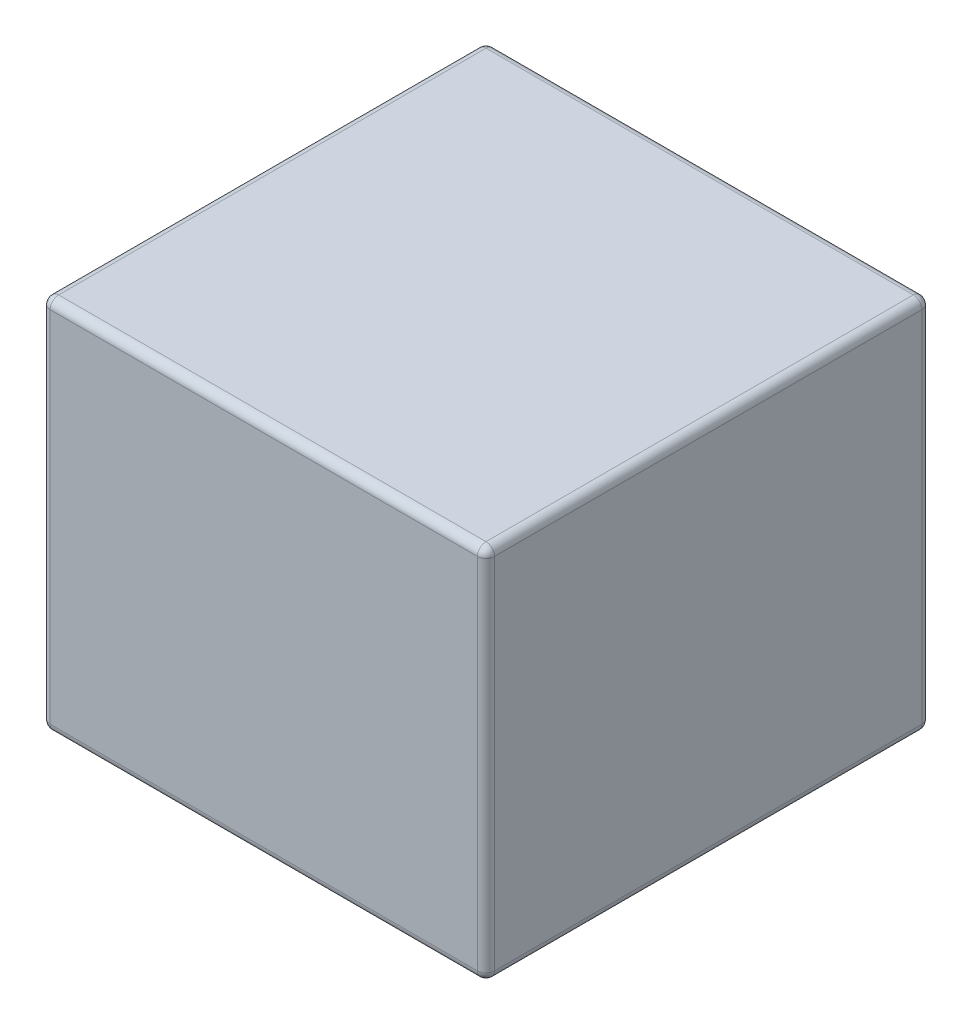
ISO-10303-21;
HEADER;
FILE_DESCRIPTION(('STEP AP214'),'2;1');
FILE_NAME('part.step','',(''),(''),'','','');
FILE_SCHEMA(('AUTOMOTIVE_DESIGN { 1 0 10303 214 1 1 1 1 }'));
ENDSEC;
DATA;
#1=APPLICATION_CONTEXT('core data for automotive mechanical design processes');
#2=APPLICATION_PROTOCOL_DEFINITION('international standard','automotive_design',2000,#1);
#3=PRODUCT_CONTEXT('',#1,'mechanical');
#4=PRODUCT('Part','Part','',(#3));
#5=PRODUCT_RELATED_PRODUCT_CATEGORY('part','',(#4));
#6=PRODUCT_DEFINITION_FORMATION('','',#4);
#7=PRODUCT_DEFINITION_CONTEXT('part definition',#1,'design');
#8=PRODUCT_DEFINITION('design','',#6,#7);
#9=PRODUCT_DEFINITION_SHAPE('','',#8);
#10=(LENGTH_UNIT() NAMED_UNIT(*) SI_UNIT(.MILLI.,.METRE.));
#11=(NAMED_UNIT(*) PLANE_ANGLE_UNIT() SI_UNIT($,.RADIAN.));
#12=(NAMED_UNIT(*) SI_UNIT($,.STERADIAN.) SOLID_ANGLE_UNIT());
#13=UNCERTAINTY_MEASURE_WITH_UNIT(LENGTH_MEASURE(1.E-05),#10,'distance_accuracy_value','');
#14=(GEOMETRIC_REPRESENTATION_CONTEXT(3) GLOBAL_UNCERTAINTY_ASSIGNED_CONTEXT((#13)) GLOBAL_UNIT_ASSIGNED_CONTEXT((#10,
#11,#12)) REPRESENTATION_CONTEXT('',''));
#15=CARTESIAN_POINT('',(0.,0.,0.));
#16=DIRECTION('',(0.,0.,1.));
#17=DIRECTION('',(1.,0.,0.));
#18=AXIS2_PLACEMENT_3D('',#15,#16,#17);
#19=CARTESIAN_POINT('',(0.,279.4,0.));
#20=DIRECTION('',(1.,0.,0.));
#21=DIRECTION('',(0.,0.,-1.));
#22=AXIS2_PLACEMENT_3D('',#19,#20,#21);
#23=PLANE('',#22);
#24=DIRECTION('',(0.,-1.,0.));
#25=VECTOR('',#24,1.);
#26=CARTESIAN_POINT('',(0.,279.4,-323.85));
#27=LINE('',#26,#25);
#28=CARTESIAN_POINT('',(0.,273.05,-323.85));
#29=VERTEX_POINT('',#28);
#30=CARTESIAN_POINT('',(0.,6.35000000000002,-323.85));
#31=VERTEX_POINT('',#30);
#32=EDGE_CURVE('E148',#29,#31,#27,.T.);
#33=ORIENTED_EDGE('',*,*,#32,.T.);
#34=DIRECTION('',(0.,0.,1.));
#35=VECTOR('',#34,1.);
#36=CARTESIAN_POINT('',(0.,6.35000000000002,0.));
#37=LINE('',#36,#35);
#38=CARTESIAN_POINT('',(0.,6.35000000000002,-6.35));
#39=VERTEX_POINT('',#38);
#40=EDGE_CURVE('E143',#31,#39,#37,.T.);
#41=ORIENTED_EDGE('',*,*,#40,.T.);
#42=DIRECTION('',(0.,-1.,0.));
#43=VECTOR('',#42,1.);
#44=CARTESIAN_POINT('',(0.,279.4,-6.35));
#45=LINE('',#44,#43);
#46=CARTESIAN_POINT('',(0.,273.05,-6.35));
#47=VERTEX_POINT('',#46);
#48=EDGE_CURVE('E138',#39,#47,#45,.F.);
#49=ORIENTED_EDGE('',*,*,#48,.T.);
#50=DIRECTION('',(0.,0.,1.));
#51=VECTOR('',#50,1.);
#52=CARTESIAN_POINT('',(0.,273.05,0.));
#53=LINE('',#52,#51);
#54=EDGE_CURVE('E140',#47,#29,#53,.F.);
#55=ORIENTED_EDGE('',*,*,#54,.T.);
#56=EDGE_LOOP('',(#33,#41,#49,#55));
#57=FACE_BOUND('',#56,.T.);
#58=ADVANCED_FACE('F38',(#57),#23,.F.);
#59=CARTESIAN_POINT('',(0.,279.4,0.));
#60=DIRECTION('',(0.,0.,-1.));
#61=DIRECTION('',(-1.,0.,0.));
#62=AXIS2_PLACEMENT_3D('',#59,#60,#61);
#63=PLANE('',#62);
#64=DIRECTION('',(0.,-1.,0.));
#65=VECTOR('',#64,1.);
#66=CARTESIAN_POINT('',(6.35,279.4,0.));
#67=LINE('',#66,#65);
#68=CARTESIAN_POINT('',(6.35,273.05,0.));
#69=VERTEX_POINT('',#68);
#70=CARTESIAN_POINT('',(6.35,6.35000000000002,0.));
#71=VERTEX_POINT('',#70);
#72=EDGE_CURVE('E172',#69,#71,#67,.T.);
#73=ORIENTED_EDGE('',*,*,#72,.T.);
#74=DIRECTION('',(1.,0.,0.));
#75=VECTOR('',#74,1.);
#76=CARTESIAN_POINT('',(330.2,6.35000000000002,0.));
#77=LINE('',#76,#75);
#78=CARTESIAN_POINT('',(323.85,6.35000000000002,0.));
#79=VERTEX_POINT('',#78);
#80=EDGE_CURVE('E265',#71,#79,#77,.T.);
#81=ORIENTED_EDGE('',*,*,#80,.T.);
#82=DIRECTION('',(0.,-1.,0.));
#83=VECTOR('',#82,1.);
#84=CARTESIAN_POINT('',(323.85,279.4,0.));
#85=LINE('',#84,#83);
#86=CARTESIAN_POINT('',(323.85,273.05,0.));
#87=VERTEX_POINT('',#86);
#88=EDGE_CURVE('E255',#79,#87,#85,.F.);
#89=ORIENTED_EDGE('',*,*,#88,.T.);
#90=DIRECTION('',(1.,0.,0.));
#91=VECTOR('',#90,1.);
#92=CARTESIAN_POINT('',(0.,273.05,0.));
#93=LINE('',#92,#91);
#94=EDGE_CURVE('E252',#87,#69,#93,.F.);
#95=ORIENTED_EDGE('',*,*,#94,.T.);
#96=EDGE_LOOP('',(#73,#81,#89,#95));
#97=FACE_BOUND('',#96,.T.);
#98=ADVANCED_FACE('F372',(#97),#63,.F.);
#99=CARTESIAN_POINT('',(330.2,279.4,0.));
#100=DIRECTION('',(-1.,0.,0.));
#101=DIRECTION('',(0.,0.,1.));
#102=AXIS2_PLACEMENT_3D('',#99,#100,#101);
#103=PLANE('',#102);
#104=DIRECTION('',(0.,0.,-1.));
#105=VECTOR('',#104,1.);
#106=CARTESIAN_POINT('',(330.2,6.35000000000002,-330.2));
#107=LINE('',#106,#105);
#108=CARTESIAN_POINT('',(330.2,6.35000000000002,-6.35));
#109=VERTEX_POINT('',#108);
#110=CARTESIAN_POINT('',(330.2,6.35000000000002,-323.85));
#111=VERTEX_POINT('',#110);
#112=EDGE_CURVE('E247',#109,#111,#107,.T.);
#113=ORIENTED_EDGE('',*,*,#112,.T.);
#114=DIRECTION('',(0.,-1.,0.));
#115=VECTOR('',#114,1.);
#116=CARTESIAN_POINT('',(330.2,279.4,-323.85));
#117=LINE('',#116,#115);
#118=CARTESIAN_POINT('',(330.2,273.05,-323.85));
#119=VERTEX_POINT('',#118);
#120=EDGE_CURVE('E244',#111,#119,#117,.F.);
#121=ORIENTED_EDGE('',*,*,#120,.T.);
#122=DIRECTION('',(0.,0.,-1.));
#123=VECTOR('',#122,1.);
#124=CARTESIAN_POINT('',(330.2,273.05,0.));
#125=LINE('',#124,#123);
#126=CARTESIAN_POINT('',(330.2,273.05,-6.35));
#127=VERTEX_POINT('',#126);
#128=EDGE_CURVE('E236',#119,#127,#125,.F.);
#129=ORIENTED_EDGE('',*,*,#128,.T.);
#130=DIRECTION('',(0.,-1.,0.));
#131=VECTOR('',#130,1.);
#132=CARTESIAN_POINT('',(330.2,279.4,-6.35));
#133=LINE('',#132,#131);
#134=EDGE_CURVE('E240',#127,#109,#133,.T.);
#135=ORIENTED_EDGE('',*,*,#134,.T.);
#136=EDGE_LOOP('',(#113,#121,#129,#135));
#137=FACE_BOUND('',#136,.T.);
#138=ADVANCED_FACE('F245',(#137),#103,.F.);
#139=CARTESIAN_POINT('',(0.,279.4,-330.2));
#140=DIRECTION('',(0.,0.,1.));
#141=DIRECTION('',(1.,0.,0.));
#142=AXIS2_PLACEMENT_3D('',#139,#140,#141);
#143=PLANE('',#142);
#144=DIRECTION('',(-1.,0.,0.));
#145=VECTOR('',#144,1.);
#146=CARTESIAN_POINT('',(0.,6.35000000000002,-330.2));
#147=LINE('',#146,#145);
#148=CARTESIAN_POINT('',(323.85,6.35000000000002,-330.2));
#149=VERTEX_POINT('',#148);
#150=CARTESIAN_POINT('',(6.35,6.35000000000002,-330.2));
#151=VERTEX_POINT('',#150);
#152=EDGE_CURVE('E324',#149,#151,#147,.T.);
#153=ORIENTED_EDGE('',*,*,#152,.T.);
#154=DIRECTION('',(0.,-1.,0.));
#155=VECTOR('',#154,1.);
#156=CARTESIAN_POINT('',(6.35,279.4,-330.2));
#157=LINE('',#156,#155);
#158=CARTESIAN_POINT('',(6.35,273.05,-330.2));
#159=VERTEX_POINT('',#158);
#160=EDGE_CURVE('E241',#151,#159,#157,.F.);
#161=ORIENTED_EDGE('',*,*,#160,.T.);
#162=DIRECTION('',(-1.,0.,0.));
#163=VECTOR('',#162,1.);
#164=CARTESIAN_POINT('',(0.,273.05,-330.2));
#165=LINE('',#164,#163);
#166=CARTESIAN_POINT('',(323.85,273.05,-330.2));
#167=VERTEX_POINT('',#166);
#168=EDGE_CURVE('E315',#159,#167,#165,.F.);
#169=ORIENTED_EDGE('',*,*,#168,.T.);
#170=DIRECTION('',(0.,-1.,0.));
#171=VECTOR('',#170,1.);
#172=CARTESIAN_POINT('',(323.85,279.4,-330.2));
#173=LINE('',#172,#171);
#174=EDGE_CURVE('E318',#167,#149,#173,.T.);
#175=ORIENTED_EDGE('',*,*,#174,.T.);
#176=EDGE_LOOP('',(#153,#161,#169,#175));
#177=FACE_BOUND('',#176,.T.);
#178=ADVANCED_FACE('F356',(#177),#143,.F.);
#179=CARTESIAN_POINT('',(0.,279.4,0.));
#180=DIRECTION('',(0.,-1.,0.));
#181=DIRECTION('',(0.,0.,-1.));
#182=AXIS2_PLACEMENT_3D('',#179,#180,#181);
#183=PLANE('',#182);
#184=DIRECTION('',(0.,0.,-1.));
#185=VECTOR('',#184,1.);
#186=CARTESIAN_POINT('',(323.85,279.4,0.));
#187=LINE('',#186,#185);
#188=CARTESIAN_POINT('',(323.85,279.4,-6.35));
#189=VERTEX_POINT('',#188);
#190=CARTESIAN_POINT('',(323.85,279.4,-323.85));
#191=VERTEX_POINT('',#190);
#192=EDGE_CURVE('E48',#189,#191,#187,.T.);
#193=ORIENTED_EDGE('',*,*,#192,.T.);
#194=DIRECTION('',(-1.,0.,0.));
#195=VECTOR('',#194,1.);
#196=CARTESIAN_POINT('',(0.,279.4,-323.85));
#197=LINE('',#196,#195);
#198=CARTESIAN_POINT('',(6.35,279.4,-323.85));
#199=VERTEX_POINT('',#198);
#200=EDGE_CURVE('E11',#191,#199,#197,.T.);
#201=ORIENTED_EDGE('',*,*,#200,.T.);
#202=DIRECTION('',(0.,0.,1.));
#203=VECTOR('',#202,1.);
#204=CARTESIAN_POINT('',(6.35,279.4,0.));
#205=LINE('',#204,#203);
#206=CARTESIAN_POINT('',(6.35,279.4,-6.35));
#207=VERTEX_POINT('',#206);
#208=EDGE_CURVE('E268',#199,#207,#205,.T.);
#209=ORIENTED_EDGE('',*,*,#208,.T.);
#210=DIRECTION('',(1.,0.,0.));
#211=VECTOR('',#210,1.);
#212=CARTESIAN_POINT('',(0.,279.4,-6.35));
#213=LINE('',#212,#211);
#214=EDGE_CURVE('E59',#207,#189,#213,.T.);
#215=ORIENTED_EDGE('',*,*,#214,.T.);
#216=EDGE_LOOP('',(#193,#201,#209,#215));
#217=FACE_BOUND('',#216,.T.);
#218=ADVANCED_FACE('F459',(#217),#183,.F.);
#219=CARTESIAN_POINT('',(0.,0.,0.));
#220=DIRECTION('',(0.,-1.,0.));
#221=DIRECTION('',(0.,0.,-1.));
#222=AXIS2_PLACEMENT_3D('',#219,#220,#221);
#223=PLANE('',#222);
#224=DIRECTION('',(1.,0.,0.));
#225=VECTOR('',#224,1.);
#226=CARTESIAN_POINT('',(0.,0.,-6.35));
#227=LINE('',#226,#225);
#228=CARTESIAN_POINT('',(323.85,0.,-6.35));
#229=VERTEX_POINT('',#228);
#230=CARTESIAN_POINT('',(6.35,0.,-6.35));
#231=VERTEX_POINT('',#230);
#232=EDGE_CURVE('E311',#229,#231,#227,.F.);
#233=ORIENTED_EDGE('',*,*,#232,.T.);
#234=DIRECTION('',(0.,0.,1.));
#235=VECTOR('',#234,1.);
#236=CARTESIAN_POINT('',(6.35,0.,-330.2));
#237=LINE('',#236,#235);
#238=CARTESIAN_POINT('',(6.35,0.,-323.85));
#239=VERTEX_POINT('',#238);
#240=EDGE_CURVE('E305',#231,#239,#237,.F.);
#241=ORIENTED_EDGE('',*,*,#240,.T.);
#242=DIRECTION('',(-1.,0.,0.));
#243=VECTOR('',#242,1.);
#244=CARTESIAN_POINT('',(330.2,0.,-323.85));
#245=LINE('',#244,#243);
#246=CARTESIAN_POINT('',(323.85,0.,-323.85));
#247=VERTEX_POINT('',#246);
#248=EDGE_CURVE('E298',#239,#247,#245,.F.);
#249=ORIENTED_EDGE('',*,*,#248,.T.);
#250=DIRECTION('',(0.,0.,-1.));
#251=VECTOR('',#250,1.);
#252=CARTESIAN_POINT('',(323.85,0.,0.));
#253=LINE('',#252,#251);
#254=EDGE_CURVE('E306',#247,#229,#253,.F.);
#255=ORIENTED_EDGE('',*,*,#254,.T.);
#256=EDGE_LOOP('',(#233,#241,#249,#255));
#257=FACE_BOUND('',#256,.T.);
#258=ADVANCED_FACE('F309',(#257),#223,.T.);
#259=CARTESIAN_POINT('',(323.85,273.05,0.));
#260=DIRECTION('',(0.,0.,-1.));
#261=DIRECTION('',(-1.,0.,0.));
#262=AXIS2_PLACEMENT_3D('',#259,#260,#261);
#263=CYLINDRICAL_SURFACE('',#262,6.35);
#264=CARTESIAN_POINT('',(323.85,273.05,-323.85));
#265=DIRECTION('',(0.,0.,-1.));
#266=DIRECTION('',(-1.,0.,0.));
#267=AXIS2_PLACEMENT_3D('',#264,#265,#266);
#268=CIRCLE('',#267,6.35);
#269=EDGE_CURVE('E42',#191,#119,#268,.T.);
#270=ORIENTED_EDGE('',*,*,#269,.F.);
#271=ORIENTED_EDGE('',*,*,#192,.F.);
#272=CARTESIAN_POINT('',(323.85,273.05,-6.35));
#273=DIRECTION('',(0.,0.,1.));
#274=DIRECTION('',(1.,0.,0.));
#275=AXIS2_PLACEMENT_3D('',#272,#273,#274);
#276=CIRCLE('',#275,6.35);
#277=EDGE_CURVE('E221',#127,#189,#276,.T.);
#278=ORIENTED_EDGE('',*,*,#277,.F.);
#279=ORIENTED_EDGE('',*,*,#128,.F.);
#280=EDGE_LOOP('',(#270,#271,#278,#279));
#281=FACE_BOUND('',#280,.T.);
#282=ADVANCED_FACE('F40',(#281),#263,.T.);
#283=CARTESIAN_POINT('',(323.85,273.05,-323.85));
#284=DIRECTION('',(0.,0.,1.));
#285=DIRECTION('',(1.,0.,0.));
#286=AXIS2_PLACEMENT_3D('',#283,#284,#285);
#287=SPHERICAL_SURFACE('',#286,6.35);
#288=CARTESIAN_POINT('',(323.85,273.05,-323.85));
#289=DIRECTION('',(1.,0.,0.));
#290=DIRECTION('',(0.,0.,-1.));
#291=AXIS2_PLACEMENT_3D('',#288,#289,#290);
#292=CIRCLE('',#291,6.35);
#293=EDGE_CURVE('E217',#191,#167,#292,.F.);
#294=ORIENTED_EDGE('',*,*,#293,.F.);
#295=ORIENTED_EDGE('',*,*,#269,.T.);
#296=CARTESIAN_POINT('',(323.85,273.05,-323.85));
#297=DIRECTION('',(0.,1.,0.));
#298=DIRECTION('',(0.,0.,1.));
#299=AXIS2_PLACEMENT_3D('',#296,#297,#298);
#300=CIRCLE('',#299,6.35);
#301=EDGE_CURVE('E220',#167,#119,#300,.F.);
#302=ORIENTED_EDGE('',*,*,#301,.F.);
#303=EDGE_LOOP('',(#294,#295,#302));
#304=FACE_BOUND('',#303,.T.);
#305=ADVANCED_FACE('F232',(#304),#287,.T.);
#306=CARTESIAN_POINT('',(323.85,273.05,-6.35));
#307=DIRECTION('',(0.,0.,1.));
#308=DIRECTION('',(1.,0.,0.));
#309=AXIS2_PLACEMENT_3D('',#306,#307,#308);
#310=SPHERICAL_SURFACE('',#309,6.35);
#311=CARTESIAN_POINT('',(323.85,273.05,-6.35));
#312=DIRECTION('',(0.,1.,0.));
#313=DIRECTION('',(0.,0.,1.));
#314=AXIS2_PLACEMENT_3D('',#311,#312,#313);
#315=CIRCLE('',#314,6.35);
#316=EDGE_CURVE('E211',#127,#87,#315,.F.);
#317=ORIENTED_EDGE('',*,*,#316,.F.);
#318=ORIENTED_EDGE('',*,*,#277,.T.);
#319=CARTESIAN_POINT('',(323.85,273.05,-6.35));
#320=DIRECTION('',(1.,0.,0.));
#321=DIRECTION('',(0.,0.,-1.));
#322=AXIS2_PLACEMENT_3D('',#319,#320,#321);
#323=CIRCLE('',#322,6.35);
#324=EDGE_CURVE('E214',#87,#189,#323,.F.);
#325=ORIENTED_EDGE('',*,*,#324,.F.);
#326=EDGE_LOOP('',(#317,#318,#325));
#327=FACE_BOUND('',#326,.T.);
#328=ADVANCED_FACE('F515',(#327),#310,.T.);
#329=CARTESIAN_POINT('',(323.85,279.4,-323.85));
#330=DIRECTION('',(0.,-1.,0.));
#331=DIRECTION('',(0.,0.,-1.));
#332=AXIS2_PLACEMENT_3D('',#329,#330,#331);
#333=CYLINDRICAL_SURFACE('',#332,6.35);
#334=ORIENTED_EDGE('',*,*,#301,.T.);
#335=ORIENTED_EDGE('',*,*,#120,.F.);
#336=CARTESIAN_POINT('',(323.85,6.35000000000002,-323.85));
#337=DIRECTION('',(0.,-1.,0.));
#338=DIRECTION('',(0.,0.,-1.));
#339=AXIS2_PLACEMENT_3D('',#336,#337,#338);
#340=CIRCLE('',#339,6.35);
#341=EDGE_CURVE('E203',#149,#111,#340,.T.);
#342=ORIENTED_EDGE('',*,*,#341,.F.);
#343=ORIENTED_EDGE('',*,*,#174,.F.);
#344=EDGE_LOOP('',(#334,#335,#342,#343));
#345=FACE_BOUND('',#344,.T.);
#346=ADVANCED_FACE('F358',(#345),#333,.T.);
#347=CARTESIAN_POINT('',(0.,273.05,-323.85));
#348=DIRECTION('',(-1.,0.,0.));
#349=DIRECTION('',(0.,0.,1.));
#350=AXIS2_PLACEMENT_3D('',#347,#348,#349);
#351=CYLINDRICAL_SURFACE('',#350,6.35);
#352=ORIENTED_EDGE('',*,*,#293,.T.);
#353=ORIENTED_EDGE('',*,*,#168,.F.);
#354=CARTESIAN_POINT('',(6.35,273.05,-323.85));
#355=DIRECTION('',(-1.,0.,0.));
#356=DIRECTION('',(0.,0.,1.));
#357=AXIS2_PLACEMENT_3D('',#354,#355,#356);
#358=CIRCLE('',#357,6.35);
#359=EDGE_CURVE('E200',#199,#159,#358,.T.);
#360=ORIENTED_EDGE('',*,*,#359,.F.);
#361=ORIENTED_EDGE('',*,*,#200,.F.);
#362=EDGE_LOOP('',(#352,#353,#360,#361));
#363=FACE_BOUND('',#362,.T.);
#364=ADVANCED_FACE('F529',(#363),#351,.T.);
#365=CARTESIAN_POINT('',(6.35,273.05,0.));
#366=DIRECTION('',(0.,0.,1.));
#367=DIRECTION('',(1.,0.,0.));
#368=AXIS2_PLACEMENT_3D('',#365,#366,#367);
#369=CYLINDRICAL_SURFACE('',#368,6.35);
#370=CARTESIAN_POINT('',(6.35,273.05,-6.35));
#371=DIRECTION('',(0.,0.,1.));
#372=DIRECTION('',(1.,0.,0.));
#373=AXIS2_PLACEMENT_3D('',#370,#371,#372);
#374=CIRCLE('',#373,6.35);
#375=EDGE_CURVE('E155',#207,#47,#374,.T.);
#376=ORIENTED_EDGE('',*,*,#375,.F.);
#377=ORIENTED_EDGE('',*,*,#208,.F.);
#378=CARTESIAN_POINT('',(6.35,273.05,-323.85));
#379=DIRECTION('',(0.,0.,-1.));
#380=DIRECTION('',(-1.,0.,0.));
#381=AXIS2_PLACEMENT_3D('',#378,#379,#380);
#382=CIRCLE('',#381,6.35);
#383=EDGE_CURVE('E157',#29,#199,#382,.T.);
#384=ORIENTED_EDGE('',*,*,#383,.F.);
#385=ORIENTED_EDGE('',*,*,#54,.F.);
#386=EDGE_LOOP('',(#376,#377,#384,#385));
#387=FACE_BOUND('',#386,.T.);
#388=ADVANCED_FACE('F153',(#387),#369,.T.);
#389=CARTESIAN_POINT('',(0.,273.05,-6.35));
#390=DIRECTION('',(1.,0.,0.));
#391=DIRECTION('',(0.,0.,-1.));
#392=AXIS2_PLACEMENT_3D('',#389,#390,#391);
#393=CYLINDRICAL_SURFACE('',#392,6.35);
#394=ORIENTED_EDGE('',*,*,#324,.T.);
#395=ORIENTED_EDGE('',*,*,#214,.F.);
#396=CARTESIAN_POINT('',(6.35,273.05,-6.35));
#397=DIRECTION('',(-1.,0.,0.));
#398=DIRECTION('',(0.,0.,1.));
#399=AXIS2_PLACEMENT_3D('',#396,#397,#398);
#400=CIRCLE('',#399,6.35);
#401=EDGE_CURVE('E167',#69,#207,#400,.T.);
#402=ORIENTED_EDGE('',*,*,#401,.F.);
#403=ORIENTED_EDGE('',*,*,#94,.F.);
#404=EDGE_LOOP('',(#394,#395,#402,#403));
#405=FACE_BOUND('',#404,.T.);
#406=ADVANCED_FACE('F442',(#405),#393,.T.);
#407=CARTESIAN_POINT('',(323.85,279.4,-6.35));
#408=DIRECTION('',(0.,-1.,0.));
#409=DIRECTION('',(0.,0.,-1.));
#410=AXIS2_PLACEMENT_3D('',#407,#408,#409);
#411=CYLINDRICAL_SURFACE('',#410,6.35);
#412=ORIENTED_EDGE('',*,*,#316,.T.);
#413=ORIENTED_EDGE('',*,*,#88,.F.);
#414=CARTESIAN_POINT('',(323.85,6.35000000000002,-6.35));
#415=DIRECTION('',(0.,-1.,0.));
#416=DIRECTION('',(0.,0.,-1.));
#417=AXIS2_PLACEMENT_3D('',#414,#415,#416);
#418=CIRCLE('',#417,6.35);
#419=EDGE_CURVE('E194',#109,#79,#418,.T.);
#420=ORIENTED_EDGE('',*,*,#419,.F.);
#421=ORIENTED_EDGE('',*,*,#134,.F.);
#422=EDGE_LOOP('',(#412,#413,#420,#421));
#423=FACE_BOUND('',#422,.T.);
#424=ADVANCED_FACE('F338',(#423),#411,.T.);
#425=CARTESIAN_POINT('',(323.85,6.35000000000002,0.));
#426=DIRECTION('',(0.,0.,1.));
#427=DIRECTION('',(1.,0.,0.));
#428=AXIS2_PLACEMENT_3D('',#425,#426,#427);
#429=CYLINDRICAL_SURFACE('',#428,6.35);
#430=CARTESIAN_POINT('',(323.85,6.35000000000002,-323.85));
#431=DIRECTION('',(0.,0.,-1.));
#432=DIRECTION('',(-1.,0.,0.));
#433=AXIS2_PLACEMENT_3D('',#430,#431,#432);
#434=CIRCLE('',#433,6.35);
#435=EDGE_CURVE('E207',#111,#247,#434,.T.);
#436=ORIENTED_EDGE('',*,*,#435,.F.);
#437=ORIENTED_EDGE('',*,*,#112,.F.);
#438=CARTESIAN_POINT('',(323.85,6.35,-6.35));
#439=DIRECTION('',(0.,0.,1.));
#440=DIRECTION('',(1.,0.,0.));
#441=AXIS2_PLACEMENT_3D('',#438,#439,#440);
#442=CIRCLE('',#441,6.35);
#443=EDGE_CURVE('E190',#229,#109,#442,.T.);
#444=ORIENTED_EDGE('',*,*,#443,.F.);
#445=ORIENTED_EDGE('',*,*,#254,.F.);
#446=EDGE_LOOP('',(#436,#437,#444,#445));
#447=FACE_BOUND('',#446,.T.);
#448=ADVANCED_FACE('F335',(#447),#429,.T.);
#449=CARTESIAN_POINT('',(323.85,6.35,-323.85));
#450=DIRECTION('',(0.,0.,1.));
#451=DIRECTION('',(1.,0.,0.));
#452=AXIS2_PLACEMENT_3D('',#449,#450,#451);
#453=SPHERICAL_SURFACE('',#452,6.35);
#454=ORIENTED_EDGE('',*,*,#341,.T.);
#455=ORIENTED_EDGE('',*,*,#435,.T.);
#456=CARTESIAN_POINT('',(323.85,6.35,-323.85));
#457=DIRECTION('',(1.,0.,0.));
#458=DIRECTION('',(0.,0.,-1.));
#459=AXIS2_PLACEMENT_3D('',#456,#457,#458);
#460=CIRCLE('',#459,6.35);
#461=EDGE_CURVE('E179',#149,#247,#460,.F.);
#462=ORIENTED_EDGE('',*,*,#461,.F.);
#463=EDGE_LOOP('',(#454,#455,#462));
#464=FACE_BOUND('',#463,.T.);
#465=ADVANCED_FACE('F360',(#464),#453,.T.);
#466=CARTESIAN_POINT('',(6.35,273.05,-323.85));
#467=DIRECTION('',(0.,0.,1.));
#468=DIRECTION('',(1.,0.,0.));
#469=AXIS2_PLACEMENT_3D('',#466,#467,#468);
#470=SPHERICAL_SURFACE('',#469,6.35);
#471=ORIENTED_EDGE('',*,*,#383,.T.);
#472=ORIENTED_EDGE('',*,*,#359,.T.);
#473=CARTESIAN_POINT('',(6.35,273.05,-323.85));
#474=DIRECTION('',(0.,1.,0.));
#475=DIRECTION('',(0.,0.,1.));
#476=AXIS2_PLACEMENT_3D('',#473,#474,#475);
#477=CIRCLE('',#476,6.35);
#478=EDGE_CURVE('E174',#29,#159,#477,.F.);
#479=ORIENTED_EDGE('',*,*,#478,.F.);
#480=EDGE_LOOP('',(#471,#472,#479));
#481=FACE_BOUND('',#480,.T.);
#482=ADVANCED_FACE('F362',(#481),#470,.T.);
#483=CARTESIAN_POINT('',(6.35,273.05,-6.35));
#484=DIRECTION('',(0.,0.,1.));
#485=DIRECTION('',(1.,0.,0.));
#486=AXIS2_PLACEMENT_3D('',#483,#484,#485);
#487=SPHERICAL_SURFACE('',#486,6.35);
#488=ORIENTED_EDGE('',*,*,#401,.T.);
#489=ORIENTED_EDGE('',*,*,#375,.T.);
#490=CARTESIAN_POINT('',(6.35,273.05,-6.35));
#491=DIRECTION('',(0.,1.,0.));
#492=DIRECTION('',(0.,0.,1.));
#493=AXIS2_PLACEMENT_3D('',#490,#491,#492);
#494=CIRCLE('',#493,6.35);
#495=EDGE_CURVE('E164',#69,#47,#494,.F.);
#496=ORIENTED_EDGE('',*,*,#495,.F.);
#497=EDGE_LOOP('',(#488,#489,#496));
#498=FACE_BOUND('',#497,.T.);
#499=ADVANCED_FACE('F163',(#498),#487,.T.);
#500=CARTESIAN_POINT('',(323.85,6.35,-6.35));
#501=DIRECTION('',(0.,0.,1.));
#502=DIRECTION('',(1.,0.,0.));
#503=AXIS2_PLACEMENT_3D('',#500,#501,#502);
#504=SPHERICAL_SURFACE('',#503,6.35);
#505=ORIENTED_EDGE('',*,*,#443,.T.);
#506=ORIENTED_EDGE('',*,*,#419,.T.);
#507=CARTESIAN_POINT('',(323.85,6.35000000000002,-6.35));
#508=DIRECTION('',(1.,0.,0.));
#509=DIRECTION('',(0.,0.,-1.));
#510=AXIS2_PLACEMENT_3D('',#507,#508,#509);
#511=CIRCLE('',#510,6.35);
#512=EDGE_CURVE('E175',#229,#79,#511,.F.);
#513=ORIENTED_EDGE('',*,*,#512,.F.);
#514=EDGE_LOOP('',(#505,#506,#513));
#515=FACE_BOUND('',#514,.T.);
#516=ADVANCED_FACE('F340',(#515),#504,.T.);
#517=CARTESIAN_POINT('',(0.,6.35000000000002,-323.85));
#518=DIRECTION('',(1.,0.,0.));
#519=DIRECTION('',(0.,0.,-1.));
#520=AXIS2_PLACEMENT_3D('',#517,#518,#519);
#521=CYLINDRICAL_SURFACE('',#520,6.35);
#522=ORIENTED_EDGE('',*,*,#461,.T.);
#523=ORIENTED_EDGE('',*,*,#248,.F.);
#524=CARTESIAN_POINT('',(6.35,6.35000000000002,-323.85));
#525=DIRECTION('',(-1.,0.,0.));
#526=DIRECTION('',(0.,0.,1.));
#527=AXIS2_PLACEMENT_3D('',#524,#525,#526);
#528=CIRCLE('',#527,6.35);
#529=EDGE_CURVE('E183',#151,#239,#528,.T.);
#530=ORIENTED_EDGE('',*,*,#529,.F.);
#531=ORIENTED_EDGE('',*,*,#152,.F.);
#532=EDGE_LOOP('',(#522,#523,#530,#531));
#533=FACE_BOUND('',#532,.T.);
#534=ADVANCED_FACE('F300',(#533),#521,.T.);
#535=CARTESIAN_POINT('',(6.35,279.4,-323.85));
#536=DIRECTION('',(0.,-1.,0.));
#537=DIRECTION('',(0.,0.,-1.));
#538=AXIS2_PLACEMENT_3D('',#535,#536,#537);
#539=CYLINDRICAL_SURFACE('',#538,6.35);
#540=ORIENTED_EDGE('',*,*,#478,.T.);
#541=ORIENTED_EDGE('',*,*,#160,.F.);
#542=CARTESIAN_POINT('',(6.35,6.35000000000002,-323.85));
#543=DIRECTION('',(0.,-1.,0.));
#544=DIRECTION('',(0.,0.,-1.));
#545=AXIS2_PLACEMENT_3D('',#542,#543,#544);
#546=CIRCLE('',#545,6.35);
#547=EDGE_CURVE('E284',#31,#151,#546,.T.);
#548=ORIENTED_EDGE('',*,*,#547,.F.);
#549=ORIENTED_EDGE('',*,*,#32,.F.);
#550=EDGE_LOOP('',(#540,#541,#548,#549));
#551=FACE_BOUND('',#550,.T.);
#552=ADVANCED_FACE('F354',(#551),#539,.T.);
#553=CARTESIAN_POINT('',(6.35,279.4,-6.35));
#554=DIRECTION('',(0.,-1.,0.));
#555=DIRECTION('',(0.,0.,-1.));
#556=AXIS2_PLACEMENT_3D('',#553,#554,#555);
#557=CYLINDRICAL_SURFACE('',#556,6.35);
#558=ORIENTED_EDGE('',*,*,#495,.T.);
#559=ORIENTED_EDGE('',*,*,#48,.F.);
#560=CARTESIAN_POINT('',(6.35,6.35000000000002,-6.35));
#561=DIRECTION('',(0.,-1.,0.));
#562=DIRECTION('',(0.,0.,-1.));
#563=AXIS2_PLACEMENT_3D('',#560,#561,#562);
#564=CIRCLE('',#563,6.35);
#565=EDGE_CURVE('E281',#71,#39,#564,.T.);
#566=ORIENTED_EDGE('',*,*,#565,.F.);
#567=ORIENTED_EDGE('',*,*,#72,.F.);
#568=EDGE_LOOP('',(#558,#559,#566,#567));
#569=FACE_BOUND('',#568,.T.);
#570=ADVANCED_FACE('F170',(#569),#557,.T.);
#571=CARTESIAN_POINT('',(0.,6.35000000000002,-6.35));
#572=DIRECTION('',(-1.,0.,0.));
#573=DIRECTION('',(0.,0.,1.));
#574=AXIS2_PLACEMENT_3D('',#571,#572,#573);
#575=CYLINDRICAL_SURFACE('',#574,6.35);
#576=ORIENTED_EDGE('',*,*,#512,.T.);
#577=ORIENTED_EDGE('',*,*,#80,.F.);
#578=CARTESIAN_POINT('',(6.35,6.35,-6.35));
#579=DIRECTION('',(-1.,0.,0.));
#580=DIRECTION('',(0.,0.,1.));
#581=AXIS2_PLACEMENT_3D('',#578,#579,#580);
#582=CIRCLE('',#581,6.35);
#583=EDGE_CURVE('E279',#231,#71,#582,.T.);
#584=ORIENTED_EDGE('',*,*,#583,.F.);
#585=ORIENTED_EDGE('',*,*,#232,.F.);
#586=EDGE_LOOP('',(#576,#577,#584,#585));
#587=FACE_BOUND('',#586,.T.);
#588=ADVANCED_FACE('F343',(#587),#575,.T.);
#589=CARTESIAN_POINT('',(6.35,6.35,-323.85));
#590=DIRECTION('',(0.,0.,1.));
#591=DIRECTION('',(1.,0.,0.));
#592=AXIS2_PLACEMENT_3D('',#589,#590,#591);
#593=SPHERICAL_SURFACE('',#592,6.35);
#594=ORIENTED_EDGE('',*,*,#547,.T.);
#595=ORIENTED_EDGE('',*,*,#529,.T.);
#596=CARTESIAN_POINT('',(6.35,6.35,-323.85));
#597=DIRECTION('',(0.,0.,-1.));
#598=DIRECTION('',(-1.,0.,0.));
#599=AXIS2_PLACEMENT_3D('',#596,#597,#598);
#600=CIRCLE('',#599,6.35);
#601=EDGE_CURVE('E276',#31,#239,#600,.F.);
#602=ORIENTED_EDGE('',*,*,#601,.F.);
#603=EDGE_LOOP('',(#594,#595,#602));
#604=FACE_BOUND('',#603,.T.);
#605=ADVANCED_FACE('F294',(#604),#593,.T.);
#606=CARTESIAN_POINT('',(6.35,6.35,-6.35));
#607=DIRECTION('',(0.,0.,1.));
#608=DIRECTION('',(1.,0.,0.));
#609=AXIS2_PLACEMENT_3D('',#606,#607,#608);
#610=SPHERICAL_SURFACE('',#609,6.35);
#611=ORIENTED_EDGE('',*,*,#583,.T.);
#612=ORIENTED_EDGE('',*,*,#565,.T.);
#613=CARTESIAN_POINT('',(6.35,6.35000000000002,-6.35));
#614=DIRECTION('',(0.,0.,1.));
#615=DIRECTION('',(1.,0.,0.));
#616=AXIS2_PLACEMENT_3D('',#613,#614,#615);
#617=CIRCLE('',#616,6.35);
#618=EDGE_CURVE('E274',#231,#39,#617,.F.);
#619=ORIENTED_EDGE('',*,*,#618,.F.);
#620=EDGE_LOOP('',(#611,#612,#619));
#621=FACE_BOUND('',#620,.T.);
#622=ADVANCED_FACE('F384',(#621),#610,.T.);
#623=CARTESIAN_POINT('',(6.35,6.35000000000002,0.));
#624=DIRECTION('',(0.,0.,-1.));
#625=DIRECTION('',(-1.,0.,0.));
#626=AXIS2_PLACEMENT_3D('',#623,#624,#625);
#627=CYLINDRICAL_SURFACE('',#626,6.35);
#628=ORIENTED_EDGE('',*,*,#601,.T.);
#629=ORIENTED_EDGE('',*,*,#240,.F.);
#630=ORIENTED_EDGE('',*,*,#618,.T.);
#631=ORIENTED_EDGE('',*,*,#40,.F.);
#632=EDGE_LOOP('',(#628,#629,#630,#631));
#633=FACE_BOUND('',#632,.T.);
#634=ADVANCED_FACE('F381',(#633),#627,.T.);
#635=CLOSED_SHELL('',(#58,#98,#138,#178,#218,#258,#282,#305,#328,#346,#364,#388,#406,#424,#448,
#465,#482,#499,#516,#534,#552,#570,#588,#605,#622,#634));
#636=MANIFOLD_SOLID_BREP('B2',#635);
#637=ADVANCED_BREP_SHAPE_REPRESENTATION('',(#18,#636),#14);
#638=SHAPE_DEFINITION_REPRESENTATION(#9,#637);
ENDSEC;
END-ISO-10303-21;
